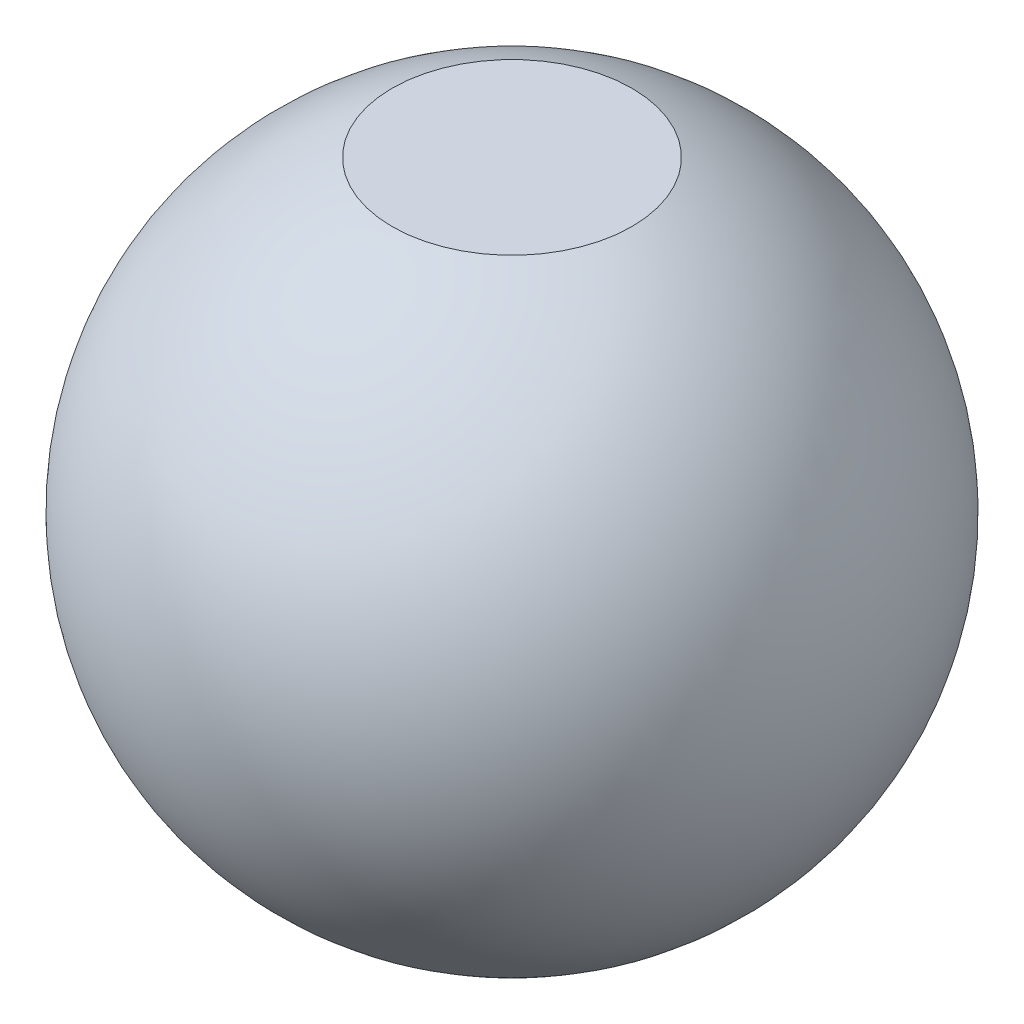
ISO-10303-21;
HEADER;
FILE_DESCRIPTION(('STEP AP214'),'2;1');
FILE_NAME('part.step','',(''),(''),'','','');
FILE_SCHEMA(('AUTOMOTIVE_DESIGN { 1 0 10303 214 1 1 1 1 }'));
ENDSEC;
DATA;
#1=APPLICATION_CONTEXT('core data for automotive mechanical design processes');
#2=APPLICATION_PROTOCOL_DEFINITION('international standard','automotive_design',2000,#1);
#3=PRODUCT_CONTEXT('',#1,'mechanical');
#4=PRODUCT('Part','Part','',(#3));
#5=PRODUCT_RELATED_PRODUCT_CATEGORY('part','',(#4));
#6=PRODUCT_DEFINITION_FORMATION('','',#4);
#7=PRODUCT_DEFINITION_CONTEXT('part definition',#1,'design');
#8=PRODUCT_DEFINITION('design','',#6,#7);
#9=PRODUCT_DEFINITION_SHAPE('','',#8);
#10=(LENGTH_UNIT() NAMED_UNIT(*) SI_UNIT(.MILLI.,.METRE.));
#11=(NAMED_UNIT(*) PLANE_ANGLE_UNIT() SI_UNIT($,.RADIAN.));
#12=(NAMED_UNIT(*) SI_UNIT($,.STERADIAN.) SOLID_ANGLE_UNIT());
#13=UNCERTAINTY_MEASURE_WITH_UNIT(LENGTH_MEASURE(1.E-05),#10,'distance_accuracy_value','');
#14=(GEOMETRIC_REPRESENTATION_CONTEXT(3) GLOBAL_UNCERTAINTY_ASSIGNED_CONTEXT((#13)) GLOBAL_UNIT_ASSIGNED_CONTEXT((#10,
#11,#12)) REPRESENTATION_CONTEXT('',''));
#15=CARTESIAN_POINT('',(0.,0.,0.));
#16=DIRECTION('',(0.,0.,1.));
#17=DIRECTION('',(1.,0.,0.));
#18=AXIS2_PLACEMENT_3D('',#15,#16,#17);
#19=CARTESIAN_POINT('',(0.,0.,0.));
#20=DIRECTION('',(0.,1.,0.));
#21=DIRECTION('',(1.,0.,0.));
#22=AXIS2_PLACEMENT_3D('',#19,#20,#21);
#23=SPHERICAL_SURFACE('',#22,55.);
#24=CARTESIAN_POINT('',(0.,51.235,0.));
#25=DIRECTION('',(0.,1.,0.));
#26=DIRECTION('',(0.,0.,1.));
#27=AXIS2_PLACEMENT_3D('',#24,#25,#26);
#28=CIRCLE('',#27,19.9993693650575);
#29=CARTESIAN_POINT('',(0.,51.235,19.9993693650575));
#30=VERTEX_POINT('',#29);
#31=EDGE_CURVE('E44',#30,#30,#28,.T.);
#32=ORIENTED_EDGE('',*,*,#31,.F.);
#33=EDGE_LOOP('',(#32));
#34=FACE_BOUND('',#33,.T.);
#35=CARTESIAN_POINT('',(0.,-51.235,0.));
#36=DIRECTION('',(0.,1.,0.));
#37=DIRECTION('',(0.,0.,1.));
#38=AXIS2_PLACEMENT_3D('',#35,#36,#37);
#39=CIRCLE('',#38,19.9993693650575);
#40=CARTESIAN_POINT('',(0.,-51.235,19.9993693650575));
#41=VERTEX_POINT('',#40);
#42=EDGE_CURVE('E10',#41,#41,#39,.T.);
#43=ORIENTED_EDGE('',*,*,#42,.T.);
#44=EDGE_LOOP('',(#43));
#45=FACE_BOUND('',#44,.T.);
#46=ADVANCED_FACE('F37',(#34,#45),#23,.T.);
#47=CARTESIAN_POINT('',(0.,-51.235,0.));
#48=DIRECTION('',(0.,1.,0.));
#49=DIRECTION('',(0.,0.,1.));
#50=AXIS2_PLACEMENT_3D('',#47,#48,#49);
#51=PLANE('',#50);
#52=ORIENTED_EDGE('',*,*,#42,.F.);
#53=EDGE_LOOP('',(#52));
#54=FACE_BOUND('',#53,.T.);
#55=ADVANCED_FACE('F54',(#54),#51,.F.);
#56=CARTESIAN_POINT('',(19.9993693650575,51.235,0.));
#57=DIRECTION('',(0.,-1.,0.));
#58=DIRECTION('',(0.,0.,-1.));
#59=AXIS2_PLACEMENT_3D('',#56,#57,#58);
#60=PLANE('',#59);
#61=ORIENTED_EDGE('',*,*,#31,.T.);
#62=EDGE_LOOP('',(#61));
#63=FACE_BOUND('',#62,.T.);
#64=ADVANCED_FACE('F51',(#63),#60,.F.);
#65=CLOSED_SHELL('',(#46,#55,#64));
#66=MANIFOLD_SOLID_BREP('B2',#65);
#67=ADVANCED_BREP_SHAPE_REPRESENTATION('',(#18,#66),#14);
#68=SHAPE_DEFINITION_REPRESENTATION(#9,#67);
ENDSEC;
END-ISO-10303-21;
